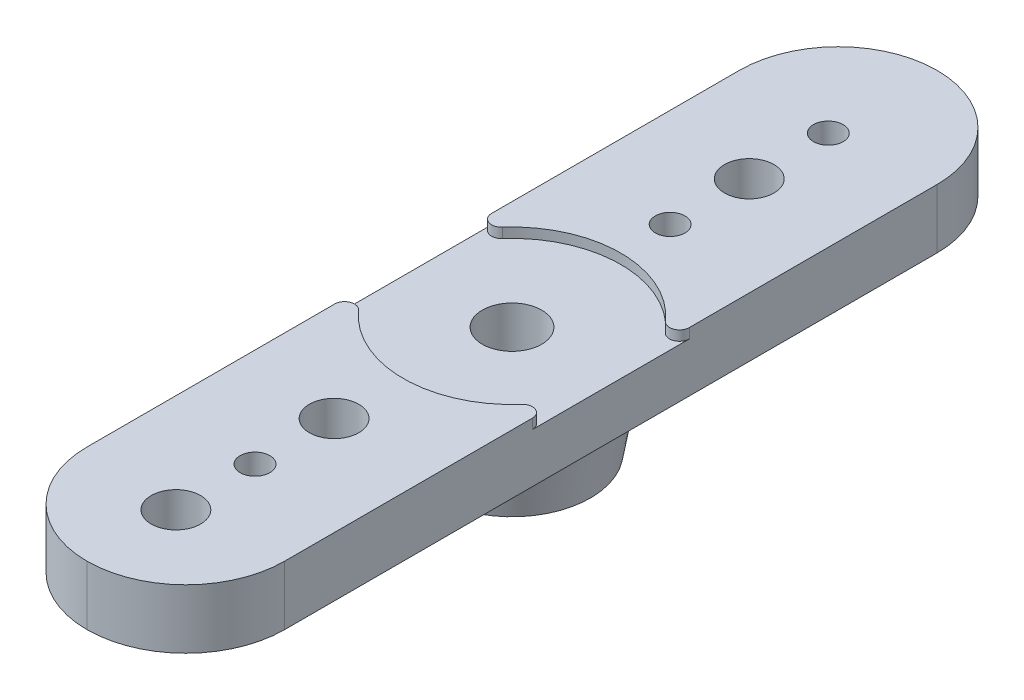
ISO-10303-21;
HEADER;
FILE_DESCRIPTION(('STEP AP214'),'2;1');
FILE_NAME('part.step','',(''),(''),'','','');
FILE_SCHEMA(('AUTOMOTIVE_DESIGN { 1 0 10303 214 1 1 1 1 }'));
ENDSEC;
DATA;
#1=APPLICATION_CONTEXT('core data for automotive mechanical design processes');
#2=APPLICATION_PROTOCOL_DEFINITION('international standard','automotive_design',2000,#1);
#3=PRODUCT_CONTEXT('',#1,'mechanical');
#4=PRODUCT('Part','Part','',(#3));
#5=PRODUCT_RELATED_PRODUCT_CATEGORY('part','',(#4));
#6=PRODUCT_DEFINITION_FORMATION('','',#4);
#7=PRODUCT_DEFINITION_CONTEXT('part definition',#1,'design');
#8=PRODUCT_DEFINITION('design','',#6,#7);
#9=PRODUCT_DEFINITION_SHAPE('','',#8);
#10=(LENGTH_UNIT() NAMED_UNIT(*) SI_UNIT(.MILLI.,.METRE.));
#11=(NAMED_UNIT(*) PLANE_ANGLE_UNIT() SI_UNIT($,.RADIAN.));
#12=(NAMED_UNIT(*) SI_UNIT($,.STERADIAN.) SOLID_ANGLE_UNIT());
#13=UNCERTAINTY_MEASURE_WITH_UNIT(LENGTH_MEASURE(1.E-05),#10,'distance_accuracy_value','');
#14=(GEOMETRIC_REPRESENTATION_CONTEXT(3) GLOBAL_UNCERTAINTY_ASSIGNED_CONTEXT((#13)) GLOBAL_UNIT_ASSIGNED_CONTEXT((#10,
#11,#12)) REPRESENTATION_CONTEXT('',''));
#15=CARTESIAN_POINT('',(0.,0.,0.));
#16=DIRECTION('',(0.,0.,1.));
#17=DIRECTION('',(1.,0.,0.));
#18=AXIS2_PLACEMENT_3D('',#15,#16,#17);
#19=CARTESIAN_POINT('',(0.,3.,0.));
#20=DIRECTION('',(0.,1.,0.));
#21=DIRECTION('',(0.,0.,1.));
#22=AXIS2_PLACEMENT_3D('',#19,#20,#21);
#23=PLANE('',#22);
#24=CARTESIAN_POINT('',(0.,3.,-8.));
#25=DIRECTION('',(0.,1.,0.));
#26=DIRECTION('',(0.,0.,1.));
#27=AXIS2_PLACEMENT_3D('',#24,#25,#26);
#28=CIRCLE('',#27,0.750000000000001);
#29=CARTESIAN_POINT('',(0.,3.,-7.25));
#30=VERTEX_POINT('',#29);
#31=EDGE_CURVE('E250',#30,#30,#28,.T.);
#32=ORIENTED_EDGE('',*,*,#31,.F.);
#33=EDGE_LOOP('',(#32));
#34=FACE_BOUND('',#33,.T.);
#35=CARTESIAN_POINT('',(0.,3.,-16.));
#36=DIRECTION('',(0.,1.,0.));
#37=DIRECTION('',(0.,0.,1.));
#38=AXIS2_PLACEMENT_3D('',#35,#36,#37);
#39=CIRCLE('',#38,0.750000000000001);
#40=CARTESIAN_POINT('',(0.,3.,-15.25));
#41=VERTEX_POINT('',#40);
#42=EDGE_CURVE('E246',#41,#41,#39,.T.);
#43=ORIENTED_EDGE('',*,*,#42,.F.);
#44=EDGE_LOOP('',(#43));
#45=FACE_BOUND('',#44,.T.);
#46=CARTESIAN_POINT('',(0.,3.,-12.));
#47=DIRECTION('',(0.,1.,0.));
#48=DIRECTION('',(0.,0.,1.));
#49=AXIS2_PLACEMENT_3D('',#46,#47,#48);
#50=CIRCLE('',#49,1.25);
#51=CARTESIAN_POINT('',(0.,3.,-10.75));
#52=VERTEX_POINT('',#51);
#53=EDGE_CURVE('E242',#52,#52,#50,.T.);
#54=ORIENTED_EDGE('',*,*,#53,.F.);
#55=EDGE_LOOP('',(#54));
#56=FACE_BOUND('',#55,.T.);
#57=CARTESIAN_POINT('',(0.,3.,0.));
#58=DIRECTION('',(0.,1.,0.));
#59=DIRECTION('',(0.,0.,1.));
#60=AXIS2_PLACEMENT_3D('',#57,#58,#59);
#61=CIRCLE('',#60,5.5);
#62=CARTESIAN_POINT('',(4.125,3.,-3.63790805271381));
#63=VERTEX_POINT('',#62);
#64=CARTESIAN_POINT('',(-4.125,3.,-3.63790805271381));
#65=VERTEX_POINT('',#64);
#66=EDGE_CURVE('E278',#63,#65,#61,.T.);
#67=ORIENTED_EDGE('',*,*,#66,.F.);
#68=CARTESIAN_POINT('',(4.5,3.,-3.96862696659688));
#69=DIRECTION('',(0.,1.,0.));
#70=DIRECTION('',(0.,0.,1.));
#71=AXIS2_PLACEMENT_3D('',#68,#69,#70);
#72=CIRCLE('',#71,0.5);
#73=CARTESIAN_POINT('',(5.,3.,-3.96862696659688));
#74=VERTEX_POINT('',#73);
#75=EDGE_CURVE('E230',#63,#74,#72,.T.);
#76=ORIENTED_EDGE('',*,*,#75,.T.);
#77=DIRECTION('',(0.,0.,-1.));
#78=VECTOR('',#77,1.);
#79=CARTESIAN_POINT('',(5.,3.,-21.5));
#80=LINE('',#79,#78);
#81=CARTESIAN_POINT('',(5.,3.,-16.5));
#82=VERTEX_POINT('',#81);
#83=EDGE_CURVE('E293',#74,#82,#80,.T.);
#84=ORIENTED_EDGE('',*,*,#83,.T.);
#85=CARTESIAN_POINT('',(0.,3.,-16.5));
#86=DIRECTION('',(0.,1.,0.));
#87=DIRECTION('',(0.,0.,1.));
#88=AXIS2_PLACEMENT_3D('',#85,#86,#87);
#89=CIRCLE('',#88,5.);
#90=CARTESIAN_POINT('',(0.,3.,-21.5));
#91=VERTEX_POINT('',#90);
#92=EDGE_CURVE('E186',#82,#91,#89,.T.);
#93=ORIENTED_EDGE('',*,*,#92,.T.);
#94=CARTESIAN_POINT('',(0.,3.,-16.5));
#95=DIRECTION('',(0.,1.,0.));
#96=DIRECTION('',(0.,0.,1.));
#97=AXIS2_PLACEMENT_3D('',#94,#95,#96);
#98=CIRCLE('',#97,5.);
#99=CARTESIAN_POINT('',(-5.,3.,-16.5));
#100=VERTEX_POINT('',#99);
#101=EDGE_CURVE('E188',#91,#100,#98,.T.);
#102=ORIENTED_EDGE('',*,*,#101,.T.);
#103=DIRECTION('',(0.,0.,1.));
#104=VECTOR('',#103,1.);
#105=CARTESIAN_POINT('',(-5.,3.,-21.5));
#106=LINE('',#105,#104);
#107=CARTESIAN_POINT('',(-5.,3.,-3.96862696659689));
#108=VERTEX_POINT('',#107);
#109=EDGE_CURVE('E161',#100,#108,#106,.T.);
#110=ORIENTED_EDGE('',*,*,#109,.T.);
#111=CARTESIAN_POINT('',(-4.5,3.,-3.96862696659689));
#112=DIRECTION('',(0.,1.,0.));
#113=DIRECTION('',(0.,0.,1.));
#114=AXIS2_PLACEMENT_3D('',#111,#112,#113);
#115=CIRCLE('',#114,0.5);
#116=EDGE_CURVE('E52',#108,#65,#115,.T.);
#117=ORIENTED_EDGE('',*,*,#116,.T.);
#118=EDGE_LOOP('',(#67,#76,#84,#93,#102,#110,#117));
#119=FACE_BOUND('',#118,.T.);
#120=ADVANCED_FACE('F35',(#34,#45,#56,#119),#23,.T.);
#121=CARTESIAN_POINT('',(0.,3.,0.));
#122=DIRECTION('',(0.,-1.,0.));
#123=DIRECTION('',(0.,0.,-1.));
#124=AXIS2_PLACEMENT_3D('',#121,#122,#123);
#125=CYLINDRICAL_SURFACE('',#124,1.5);
#126=CARTESIAN_POINT('',(0.,0.,0.));
#127=DIRECTION('',(0.,-1.,0.));
#128=DIRECTION('',(0.,0.,-1.));
#129=AXIS2_PLACEMENT_3D('',#126,#127,#128);
#130=CIRCLE('',#129,1.5);
#131=CARTESIAN_POINT('',(0.,0.,-1.5));
#132=VERTEX_POINT('',#131);
#133=EDGE_CURVE('E283',#132,#132,#130,.T.);
#134=ORIENTED_EDGE('',*,*,#133,.T.);
#135=EDGE_LOOP('',(#134));
#136=FACE_BOUND('',#135,.T.);
#137=CARTESIAN_POINT('',(0.,2.5,0.));
#138=DIRECTION('',(0.,1.,0.));
#139=DIRECTION('',(0.,0.,1.));
#140=AXIS2_PLACEMENT_3D('',#137,#138,#139);
#141=CIRCLE('',#140,1.5);
#142=CARTESIAN_POINT('',(0.,2.5,1.5));
#143=VERTEX_POINT('',#142);
#144=EDGE_CURVE('E203',#143,#143,#141,.F.);
#145=ORIENTED_EDGE('',*,*,#144,.F.);
#146=EDGE_LOOP('',(#145));
#147=FACE_BOUND('',#146,.T.);
#148=ADVANCED_FACE('F354',(#136,#147),#125,.F.);
#149=CARTESIAN_POINT('',(-5.,3.,-21.5));
#150=DIRECTION('',(1.,0.,0.));
#151=DIRECTION('',(0.,0.,-1.));
#152=AXIS2_PLACEMENT_3D('',#149,#150,#151);
#153=PLANE('',#152);
#154=CARTESIAN_POINT('',(-5.,3.,3.96862696659689));
#155=VERTEX_POINT('',#154);
#156=CARTESIAN_POINT('',(-5.,3.,16.5));
#157=VERTEX_POINT('',#156);
#158=EDGE_CURVE('E170',#155,#157,#106,.T.);
#159=ORIENTED_EDGE('',*,*,#158,.F.);
#160=DIRECTION('',(0.,1.,0.));
#161=VECTOR('',#160,1.);
#162=CARTESIAN_POINT('',(-5.,3.,3.96862696659689));
#163=LINE('',#162,#161);
#164=CARTESIAN_POINT('',(-5.,2.5,3.96862696659689));
#165=VERTEX_POINT('',#164);
#166=EDGE_CURVE('E223',#155,#165,#163,.F.);
#167=ORIENTED_EDGE('',*,*,#166,.T.);
#168=DIRECTION('',(0.,0.,1.));
#169=VECTOR('',#168,1.);
#170=CARTESIAN_POINT('',(-5.,2.5,-21.5));
#171=LINE('',#170,#169);
#172=CARTESIAN_POINT('',(-5.,2.5,-3.96862696659689));
#173=VERTEX_POINT('',#172);
#174=EDGE_CURVE('E281',#173,#165,#171,.T.);
#175=ORIENTED_EDGE('',*,*,#174,.F.);
#176=DIRECTION('',(0.,1.,0.));
#177=VECTOR('',#176,1.);
#178=CARTESIAN_POINT('',(-5.,3.,-3.96862696659689));
#179=LINE('',#178,#177);
#180=EDGE_CURVE('E221',#173,#108,#179,.T.);
#181=ORIENTED_EDGE('',*,*,#180,.T.);
#182=ORIENTED_EDGE('',*,*,#109,.F.);
#183=DIRECTION('',(0.,-1.,0.));
#184=VECTOR('',#183,1.);
#185=CARTESIAN_POINT('',(-5.,3.,-16.5));
#186=LINE('',#185,#184);
#187=CARTESIAN_POINT('',(-5.,0.,-16.5));
#188=VERTEX_POINT('',#187);
#189=EDGE_CURVE('E143',#100,#188,#186,.T.);
#190=ORIENTED_EDGE('',*,*,#189,.T.);
#191=DIRECTION('',(0.,0.,1.));
#192=VECTOR('',#191,1.);
#193=CARTESIAN_POINT('',(-5.,0.,-21.5));
#194=LINE('',#193,#192);
#195=CARTESIAN_POINT('',(-5.,0.,16.5));
#196=VERTEX_POINT('',#195);
#197=EDGE_CURVE('E158',#188,#196,#194,.T.);
#198=ORIENTED_EDGE('',*,*,#197,.T.);
#199=DIRECTION('',(0.,-1.,0.));
#200=VECTOR('',#199,1.);
#201=CARTESIAN_POINT('',(-5.,3.,16.5));
#202=LINE('',#201,#200);
#203=EDGE_CURVE('E163',#196,#157,#202,.F.);
#204=ORIENTED_EDGE('',*,*,#203,.T.);
#205=EDGE_LOOP('',(#159,#167,#175,#181,#182,#190,#198,#204));
#206=FACE_BOUND('',#205,.T.);
#207=ADVANCED_FACE('F156',(#206),#153,.F.);
#208=CARTESIAN_POINT('',(5.,3.,-21.5));
#209=DIRECTION('',(-1.,0.,0.));
#210=DIRECTION('',(0.,0.,1.));
#211=AXIS2_PLACEMENT_3D('',#208,#209,#210);
#212=PLANE('',#211);
#213=DIRECTION('',(0.,0.,-1.));
#214=VECTOR('',#213,1.);
#215=CARTESIAN_POINT('',(5.,2.5,-21.5));
#216=LINE('',#215,#214);
#217=CARTESIAN_POINT('',(5.,2.5,3.96862696659688));
#218=VERTEX_POINT('',#217);
#219=CARTESIAN_POINT('',(5.,2.5,-3.96862696659688));
#220=VERTEX_POINT('',#219);
#221=EDGE_CURVE('E206',#218,#220,#216,.T.);
#222=ORIENTED_EDGE('',*,*,#221,.F.);
#223=DIRECTION('',(0.,1.,0.));
#224=VECTOR('',#223,1.);
#225=CARTESIAN_POINT('',(5.,3.,3.96862696659688));
#226=LINE('',#225,#224);
#227=CARTESIAN_POINT('',(5.,3.,3.96862696659688));
#228=VERTEX_POINT('',#227);
#229=EDGE_CURVE('E210',#218,#228,#226,.T.);
#230=ORIENTED_EDGE('',*,*,#229,.T.);
#231=CARTESIAN_POINT('',(5.,3.,16.5));
#232=VERTEX_POINT('',#231);
#233=EDGE_CURVE('E175',#232,#228,#80,.T.);
#234=ORIENTED_EDGE('',*,*,#233,.F.);
#235=DIRECTION('',(0.,-1.,0.));
#236=VECTOR('',#235,1.);
#237=CARTESIAN_POINT('',(5.,3.,16.5));
#238=LINE('',#237,#236);
#239=CARTESIAN_POINT('',(5.,0.,16.5));
#240=VERTEX_POINT('',#239);
#241=EDGE_CURVE('E190',#232,#240,#238,.T.);
#242=ORIENTED_EDGE('',*,*,#241,.T.);
#243=DIRECTION('',(0.,0.,-1.));
#244=VECTOR('',#243,1.);
#245=CARTESIAN_POINT('',(5.,0.,-21.5));
#246=LINE('',#245,#244);
#247=CARTESIAN_POINT('',(5.,0.,-16.5));
#248=VERTEX_POINT('',#247);
#249=EDGE_CURVE('E167',#240,#248,#246,.T.);
#250=ORIENTED_EDGE('',*,*,#249,.T.);
#251=DIRECTION('',(0.,-1.,0.));
#252=VECTOR('',#251,1.);
#253=CARTESIAN_POINT('',(5.,3.,-16.5));
#254=LINE('',#253,#252);
#255=EDGE_CURVE('E193',#248,#82,#254,.F.);
#256=ORIENTED_EDGE('',*,*,#255,.T.);
#257=ORIENTED_EDGE('',*,*,#83,.F.);
#258=DIRECTION('',(0.,1.,0.));
#259=VECTOR('',#258,1.);
#260=CARTESIAN_POINT('',(5.,3.,-3.96862696659688));
#261=LINE('',#260,#259);
#262=EDGE_CURVE('E195',#74,#220,#261,.F.);
#263=ORIENTED_EDGE('',*,*,#262,.T.);
#264=EDGE_LOOP('',(#222,#230,#234,#242,#250,#256,#257,#263));
#265=FACE_BOUND('',#264,.T.);
#266=ADVANCED_FACE('F310',(#265),#212,.F.);
#267=CARTESIAN_POINT('',(0.,3.,13.));
#268=DIRECTION('',(0.,1.,0.));
#269=DIRECTION('',(0.,0.,1.));
#270=AXIS2_PLACEMENT_3D('',#267,#268,#269);
#271=CIRCLE('',#270,0.750000000000001);
#272=CARTESIAN_POINT('',(0.,3.,13.75));
#273=VERTEX_POINT('',#272);
#274=EDGE_CURVE('E266',#273,#273,#271,.T.);
#275=ORIENTED_EDGE('',*,*,#274,.F.);
#276=EDGE_LOOP('',(#275));
#277=FACE_BOUND('',#276,.T.);
#278=CARTESIAN_POINT('',(0.,3.,9.));
#279=DIRECTION('',(0.,1.,0.));
#280=DIRECTION('',(0.,0.,1.));
#281=AXIS2_PLACEMENT_3D('',#278,#279,#280);
#282=CIRCLE('',#281,1.25);
#283=CARTESIAN_POINT('',(0.,3.,10.25));
#284=VERTEX_POINT('',#283);
#285=EDGE_CURVE('E256',#284,#284,#282,.T.);
#286=ORIENTED_EDGE('',*,*,#285,.F.);
#287=EDGE_LOOP('',(#286));
#288=FACE_BOUND('',#287,.T.);
#289=CARTESIAN_POINT('',(0.,3.,17.));
#290=DIRECTION('',(0.,1.,0.));
#291=DIRECTION('',(0.,0.,1.));
#292=AXIS2_PLACEMENT_3D('',#289,#290,#291);
#293=CIRCLE('',#292,1.25);
#294=CARTESIAN_POINT('',(0.,3.,18.25));
#295=VERTEX_POINT('',#294);
#296=EDGE_CURVE('E253',#295,#295,#293,.T.);
#297=ORIENTED_EDGE('',*,*,#296,.F.);
#298=EDGE_LOOP('',(#297));
#299=FACE_BOUND('',#298,.T.);
#300=ORIENTED_EDGE('',*,*,#233,.T.);
#301=CARTESIAN_POINT('',(4.5,3.,3.96862696659688));
#302=DIRECTION('',(0.,1.,0.));
#303=DIRECTION('',(0.,0.,1.));
#304=AXIS2_PLACEMENT_3D('',#301,#302,#303);
#305=CIRCLE('',#304,0.5);
#306=CARTESIAN_POINT('',(4.125,3.,3.63790805271381));
#307=VERTEX_POINT('',#306);
#308=EDGE_CURVE('E215',#228,#307,#305,.T.);
#309=ORIENTED_EDGE('',*,*,#308,.T.);
#310=CARTESIAN_POINT('',(-4.125,3.,3.63790805271381));
#311=VERTEX_POINT('',#310);
#312=EDGE_CURVE('E241',#311,#307,#61,.T.);
#313=ORIENTED_EDGE('',*,*,#312,.F.);
#314=CARTESIAN_POINT('',(-4.5,3.,3.96862696659689));
#315=DIRECTION('',(0.,1.,0.));
#316=DIRECTION('',(0.,0.,1.));
#317=AXIS2_PLACEMENT_3D('',#314,#315,#316);
#318=CIRCLE('',#317,0.5);
#319=EDGE_CURVE('E213',#311,#155,#318,.T.);
#320=ORIENTED_EDGE('',*,*,#319,.T.);
#321=ORIENTED_EDGE('',*,*,#158,.T.);
#322=CARTESIAN_POINT('',(0.,3.,16.5));
#323=DIRECTION('',(0.,1.,0.));
#324=DIRECTION('',(0.,0.,1.));
#325=AXIS2_PLACEMENT_3D('',#322,#323,#324);
#326=CIRCLE('',#325,5.);
#327=CARTESIAN_POINT('',(0.,3.,21.5));
#328=VERTEX_POINT('',#327);
#329=EDGE_CURVE('E149',#157,#328,#326,.T.);
#330=ORIENTED_EDGE('',*,*,#329,.T.);
#331=CARTESIAN_POINT('',(0.,3.,16.5));
#332=DIRECTION('',(0.,1.,0.));
#333=DIRECTION('',(0.,0.,1.));
#334=AXIS2_PLACEMENT_3D('',#331,#332,#333);
#335=CIRCLE('',#334,5.);
#336=EDGE_CURVE('E184',#328,#232,#335,.T.);
#337=ORIENTED_EDGE('',*,*,#336,.T.);
#338=EDGE_LOOP('',(#300,#309,#313,#320,#321,#330,#337));
#339=FACE_BOUND('',#338,.T.);
#340=ADVANCED_FACE('F296',(#277,#288,#299,#339),#23,.T.);
#341=CARTESIAN_POINT('',(0.,0.,0.));
#342=DIRECTION('',(0.,1.,0.));
#343=DIRECTION('',(0.,0.,1.));
#344=AXIS2_PLACEMENT_3D('',#341,#342,#343);
#345=PLANE('',#344);
#346=CARTESIAN_POINT('',(0.,0.,13.));
#347=DIRECTION('',(0.,1.,0.));
#348=DIRECTION('',(0.,0.,1.));
#349=AXIS2_PLACEMENT_3D('',#346,#347,#348);
#350=CIRCLE('',#349,0.750000000000001);
#351=CARTESIAN_POINT('',(0.,0.,13.75));
#352=VERTEX_POINT('',#351);
#353=EDGE_CURVE('E39',#352,#352,#350,.T.);
#354=ORIENTED_EDGE('',*,*,#353,.T.);
#355=EDGE_LOOP('',(#354));
#356=FACE_BOUND('',#355,.T.);
#357=CARTESIAN_POINT('',(0.,0.,9.));
#358=DIRECTION('',(0.,1.,0.));
#359=DIRECTION('',(0.,0.,1.));
#360=AXIS2_PLACEMENT_3D('',#357,#358,#359);
#361=CIRCLE('',#360,1.25);
#362=CARTESIAN_POINT('',(0.,0.,10.25));
#363=VERTEX_POINT('',#362);
#364=EDGE_CURVE('E254',#363,#363,#361,.T.);
#365=ORIENTED_EDGE('',*,*,#364,.T.);
#366=EDGE_LOOP('',(#365));
#367=FACE_BOUND('',#366,.T.);
#368=CARTESIAN_POINT('',(0.,0.,17.));
#369=DIRECTION('',(0.,1.,0.));
#370=DIRECTION('',(0.,0.,1.));
#371=AXIS2_PLACEMENT_3D('',#368,#369,#370);
#372=CIRCLE('',#371,1.25);
#373=CARTESIAN_POINT('',(0.,0.,18.25));
#374=VERTEX_POINT('',#373);
#375=EDGE_CURVE('E251',#374,#374,#372,.T.);
#376=ORIENTED_EDGE('',*,*,#375,.T.);
#377=EDGE_LOOP('',(#376));
#378=FACE_BOUND('',#377,.T.);
#379=CARTESIAN_POINT('',(0.,0.,-8.));
#380=DIRECTION('',(0.,1.,0.));
#381=DIRECTION('',(0.,0.,1.));
#382=AXIS2_PLACEMENT_3D('',#379,#380,#381);
#383=CIRCLE('',#382,0.750000000000001);
#384=CARTESIAN_POINT('',(0.,0.,-7.25));
#385=VERTEX_POINT('',#384);
#386=EDGE_CURVE('E247',#385,#385,#383,.T.);
#387=ORIENTED_EDGE('',*,*,#386,.T.);
#388=EDGE_LOOP('',(#387));
#389=FACE_BOUND('',#388,.T.);
#390=CARTESIAN_POINT('',(0.,0.,-16.));
#391=DIRECTION('',(0.,1.,0.));
#392=DIRECTION('',(0.,0.,1.));
#393=AXIS2_PLACEMENT_3D('',#390,#391,#392);
#394=CIRCLE('',#393,0.750000000000001);
#395=CARTESIAN_POINT('',(0.,0.,-15.25));
#396=VERTEX_POINT('',#395);
#397=EDGE_CURVE('E243',#396,#396,#394,.T.);
#398=ORIENTED_EDGE('',*,*,#397,.T.);
#399=EDGE_LOOP('',(#398));
#400=FACE_BOUND('',#399,.T.);
#401=CARTESIAN_POINT('',(0.,0.,-12.));
#402=DIRECTION('',(0.,1.,0.));
#403=DIRECTION('',(0.,0.,1.));
#404=AXIS2_PLACEMENT_3D('',#401,#402,#403);
#405=CIRCLE('',#404,1.25);
#406=CARTESIAN_POINT('',(0.,0.,-10.75));
#407=VERTEX_POINT('',#406);
#408=EDGE_CURVE('E238',#407,#407,#405,.T.);
#409=ORIENTED_EDGE('',*,*,#408,.T.);
#410=EDGE_LOOP('',(#409));
#411=FACE_BOUND('',#410,.T.);
#412=CARTESIAN_POINT('',(0.,0.,0.));
#413=DIRECTION('',(0.,1.,0.));
#414=DIRECTION('',(0.,0.,1.));
#415=AXIS2_PLACEMENT_3D('',#412,#413,#414);
#416=CIRCLE('',#415,4.5);
#417=CARTESIAN_POINT('',(0.,0.,4.5));
#418=VERTEX_POINT('',#417);
#419=EDGE_CURVE('E202',#418,#418,#416,.T.);
#420=ORIENTED_EDGE('',*,*,#419,.T.);
#421=EDGE_LOOP('',(#420));
#422=FACE_BOUND('',#421,.T.);
#423=ORIENTED_EDGE('',*,*,#197,.F.);
#424=CARTESIAN_POINT('',(0.,0.,-16.5));
#425=DIRECTION('',(0.,1.,0.));
#426=DIRECTION('',(0.,0.,1.));
#427=AXIS2_PLACEMENT_3D('',#424,#425,#426);
#428=CIRCLE('',#427,5.);
#429=CARTESIAN_POINT('',(0.,0.,-21.5));
#430=VERTEX_POINT('',#429);
#431=EDGE_CURVE('E139',#188,#430,#428,.F.);
#432=ORIENTED_EDGE('',*,*,#431,.T.);
#433=CARTESIAN_POINT('',(0.,0.,-16.5));
#434=DIRECTION('',(0.,1.,0.));
#435=DIRECTION('',(0.,0.,1.));
#436=AXIS2_PLACEMENT_3D('',#433,#434,#435);
#437=CIRCLE('',#436,5.);
#438=EDGE_CURVE('E150',#430,#248,#437,.F.);
#439=ORIENTED_EDGE('',*,*,#438,.T.);
#440=ORIENTED_EDGE('',*,*,#249,.F.);
#441=CARTESIAN_POINT('',(0.,0.,16.5));
#442=DIRECTION('',(0.,1.,0.));
#443=DIRECTION('',(0.,0.,1.));
#444=AXIS2_PLACEMENT_3D('',#441,#442,#443);
#445=CIRCLE('',#444,5.);
#446=CARTESIAN_POINT('',(0.,0.,21.5));
#447=VERTEX_POINT('',#446);
#448=EDGE_CURVE('E180',#240,#447,#445,.F.);
#449=ORIENTED_EDGE('',*,*,#448,.T.);
#450=CARTESIAN_POINT('',(0.,0.,16.5));
#451=DIRECTION('',(0.,1.,0.));
#452=DIRECTION('',(0.,0.,1.));
#453=AXIS2_PLACEMENT_3D('',#450,#451,#452);
#454=CIRCLE('',#453,5.);
#455=EDGE_CURVE('E162',#447,#196,#454,.F.);
#456=ORIENTED_EDGE('',*,*,#455,.T.);
#457=EDGE_LOOP('',(#423,#432,#439,#440,#449,#456));
#458=FACE_BOUND('',#457,.T.);
#459=ADVANCED_FACE('F165',(#356,#367,#378,#389,#400,#411,#422,#458),#345,.F.);
#460=CARTESIAN_POINT('',(0.,3.,-16.5));
#461=DIRECTION('',(0.,-1.,0.));
#462=DIRECTION('',(0.,0.,-1.));
#463=AXIS2_PLACEMENT_3D('',#460,#461,#462);
#464=CYLINDRICAL_SURFACE('',#463,5.);
#465=DIRECTION('',(0.,-1.,0.));
#466=VECTOR('',#465,1.);
#467=CARTESIAN_POINT('',(0.,3.,-21.5));
#468=LINE('',#467,#466);
#469=EDGE_CURVE('E145',#91,#430,#468,.T.);
#470=ORIENTED_EDGE('',*,*,#469,.F.);
#471=ORIENTED_EDGE('',*,*,#92,.F.);
#472=ORIENTED_EDGE('',*,*,#255,.F.);
#473=ORIENTED_EDGE('',*,*,#438,.F.);
#474=EDGE_LOOP('',(#470,#471,#472,#473));
#475=FACE_BOUND('',#474,.T.);
#476=ADVANCED_FACE('F342',(#475),#464,.T.);
#477=CARTESIAN_POINT('',(0.,3.,-16.5));
#478=DIRECTION('',(0.,-1.,0.));
#479=DIRECTION('',(0.,0.,-1.));
#480=AXIS2_PLACEMENT_3D('',#477,#478,#479);
#481=CYLINDRICAL_SURFACE('',#480,5.);
#482=ORIENTED_EDGE('',*,*,#101,.F.);
#483=ORIENTED_EDGE('',*,*,#469,.T.);
#484=ORIENTED_EDGE('',*,*,#431,.F.);
#485=ORIENTED_EDGE('',*,*,#189,.F.);
#486=EDGE_LOOP('',(#482,#483,#484,#485));
#487=FACE_BOUND('',#486,.T.);
#488=ADVANCED_FACE('F142',(#487),#481,.T.);
#489=CARTESIAN_POINT('',(0.,3.,16.5));
#490=DIRECTION('',(0.,-1.,0.));
#491=DIRECTION('',(0.,0.,-1.));
#492=AXIS2_PLACEMENT_3D('',#489,#490,#491);
#493=CYLINDRICAL_SURFACE('',#492,5.);
#494=DIRECTION('',(0.,-1.,0.));
#495=VECTOR('',#494,1.);
#496=CARTESIAN_POINT('',(0.,3.,21.5));
#497=LINE('',#496,#495);
#498=EDGE_CURVE('E172',#328,#447,#497,.T.);
#499=ORIENTED_EDGE('',*,*,#498,.F.);
#500=ORIENTED_EDGE('',*,*,#329,.F.);
#501=ORIENTED_EDGE('',*,*,#203,.F.);
#502=ORIENTED_EDGE('',*,*,#455,.F.);
#503=EDGE_LOOP('',(#499,#500,#501,#502));
#504=FACE_BOUND('',#503,.T.);
#505=ADVANCED_FACE('F303',(#504),#493,.T.);
#506=CARTESIAN_POINT('',(0.,3.,16.5));
#507=DIRECTION('',(0.,-1.,0.));
#508=DIRECTION('',(0.,0.,-1.));
#509=AXIS2_PLACEMENT_3D('',#506,#507,#508);
#510=CYLINDRICAL_SURFACE('',#509,5.);
#511=ORIENTED_EDGE('',*,*,#336,.F.);
#512=ORIENTED_EDGE('',*,*,#498,.T.);
#513=ORIENTED_EDGE('',*,*,#448,.F.);
#514=ORIENTED_EDGE('',*,*,#241,.F.);
#515=EDGE_LOOP('',(#511,#512,#513,#514));
#516=FACE_BOUND('',#515,.T.);
#517=ADVANCED_FACE('F307',(#516),#510,.T.);
#518=CARTESIAN_POINT('',(0.,0.,0.));
#519=DIRECTION('',(0.,1.,0.));
#520=DIRECTION('',(0.,0.,1.));
#521=AXIS2_PLACEMENT_3D('',#518,#519,#520);
#522=CONICAL_SURFACE('',#521,4.5,0.174532925199433);
#523=CARTESIAN_POINT('',(0.,-3.,0.));
#524=DIRECTION('',(0.,1.,0.));
#525=DIRECTION('',(0.,0.,1.));
#526=AXIS2_PLACEMENT_3D('',#523,#524,#525);
#527=CIRCLE('',#526,3.9710190578746);
#528=CARTESIAN_POINT('',(0.,-3.,3.9710190578746));
#529=VERTEX_POINT('',#528);
#530=EDGE_CURVE('E199',#529,#529,#527,.T.);
#531=ORIENTED_EDGE('',*,*,#530,.T.);
#532=EDGE_LOOP('',(#531));
#533=FACE_BOUND('',#532,.T.);
#534=ORIENTED_EDGE('',*,*,#419,.F.);
#535=EDGE_LOOP('',(#534));
#536=FACE_BOUND('',#535,.T.);
#537=ADVANCED_FACE('F394',(#533,#536),#522,.T.);
#538=CARTESIAN_POINT('',(0.,-3.,0.));
#539=DIRECTION('',(0.,1.,0.));
#540=DIRECTION('',(0.,0.,1.));
#541=AXIS2_PLACEMENT_3D('',#538,#539,#540);
#542=PLANE('',#541);
#543=CARTESIAN_POINT('',(0.,-3.,0.));
#544=DIRECTION('',(0.,-1.,0.));
#545=DIRECTION('',(0.,0.,-1.));
#546=AXIS2_PLACEMENT_3D('',#543,#544,#545);
#547=CIRCLE('',#546,3.);
#548=CARTESIAN_POINT('',(0.,-3.,-3.));
#549=VERTEX_POINT('',#548);
#550=EDGE_CURVE('E286',#549,#549,#547,.T.);
#551=ORIENTED_EDGE('',*,*,#550,.F.);
#552=EDGE_LOOP('',(#551));
#553=FACE_BOUND('',#552,.T.);
#554=ORIENTED_EDGE('',*,*,#530,.F.);
#555=EDGE_LOOP('',(#554));
#556=FACE_BOUND('',#555,.T.);
#557=ADVANCED_FACE('F396',(#553,#556),#542,.F.);
#558=CARTESIAN_POINT('',(0.,0.,0.));
#559=DIRECTION('',(0.,-1.,0.));
#560=DIRECTION('',(0.,0.,-1.));
#561=AXIS2_PLACEMENT_3D('',#558,#559,#560);
#562=CYLINDRICAL_SURFACE('',#561,3.);
#563=CARTESIAN_POINT('',(0.,0.,0.));
#564=DIRECTION('',(0.,-1.,0.));
#565=DIRECTION('',(0.,0.,-1.));
#566=AXIS2_PLACEMENT_3D('',#563,#564,#565);
#567=CIRCLE('',#566,3.);
#568=CARTESIAN_POINT('',(0.,0.,-3.));
#569=VERTEX_POINT('',#568);
#570=EDGE_CURVE('E287',#569,#569,#567,.T.);
#571=ORIENTED_EDGE('',*,*,#570,.F.);
#572=EDGE_LOOP('',(#571));
#573=FACE_BOUND('',#572,.T.);
#574=ORIENTED_EDGE('',*,*,#550,.T.);
#575=EDGE_LOOP('',(#574));
#576=FACE_BOUND('',#575,.T.);
#577=ADVANCED_FACE('F403',(#573,#576),#562,.F.);
#578=CARTESIAN_POINT('',(0.,0.,0.));
#579=DIRECTION('',(0.,-1.,0.));
#580=DIRECTION('',(0.,0.,-1.));
#581=AXIS2_PLACEMENT_3D('',#578,#579,#580);
#582=PLANE('',#581);
#583=ORIENTED_EDGE('',*,*,#133,.F.);
#584=EDGE_LOOP('',(#583));
#585=FACE_BOUND('',#584,.T.);
#586=ORIENTED_EDGE('',*,*,#570,.T.);
#587=EDGE_LOOP('',(#586));
#588=FACE_BOUND('',#587,.T.);
#589=ADVANCED_FACE('F433',(#585,#588),#582,.T.);
#590=CARTESIAN_POINT('',(0.,2.5,0.));
#591=DIRECTION('',(0.,1.,0.));
#592=DIRECTION('',(0.,0.,1.));
#593=AXIS2_PLACEMENT_3D('',#590,#591,#592);
#594=CYLINDRICAL_SURFACE('',#593,5.5);
#595=CARTESIAN_POINT('',(0.,2.5,0.));
#596=DIRECTION('',(0.,1.,0.));
#597=DIRECTION('',(0.,0.,1.));
#598=AXIS2_PLACEMENT_3D('',#595,#596,#597);
#599=CIRCLE('',#598,5.5);
#600=CARTESIAN_POINT('',(4.125,2.5,-3.63790805271381));
#601=VERTEX_POINT('',#600);
#602=CARTESIAN_POINT('',(-4.125,2.5,-3.63790805271381));
#603=VERTEX_POINT('',#602);
#604=EDGE_CURVE('E207',#601,#603,#599,.T.);
#605=ORIENTED_EDGE('',*,*,#604,.F.);
#606=DIRECTION('',(0.,1.,0.));
#607=VECTOR('',#606,1.);
#608=CARTESIAN_POINT('',(4.125,2.5,-3.63790805271381));
#609=LINE('',#608,#607);
#610=EDGE_CURVE('E59',#601,#63,#609,.T.);
#611=ORIENTED_EDGE('',*,*,#610,.T.);
#612=ORIENTED_EDGE('',*,*,#66,.T.);
#613=DIRECTION('',(0.,1.,0.));
#614=VECTOR('',#613,1.);
#615=CARTESIAN_POINT('',(-4.125,2.5,-3.63790805271381));
#616=LINE('',#615,#614);
#617=EDGE_CURVE('E226',#65,#603,#616,.F.);
#618=ORIENTED_EDGE('',*,*,#617,.T.);
#619=EDGE_LOOP('',(#605,#611,#612,#618));
#620=FACE_BOUND('',#619,.T.);
#621=ADVANCED_FACE('F332',(#620),#594,.F.);
#622=ORIENTED_EDGE('',*,*,#312,.T.);
#623=DIRECTION('',(0.,1.,0.));
#624=VECTOR('',#623,1.);
#625=CARTESIAN_POINT('',(4.125,2.5,3.63790805271381));
#626=LINE('',#625,#624);
#627=CARTESIAN_POINT('',(4.125,2.5,3.63790805271381));
#628=VERTEX_POINT('',#627);
#629=EDGE_CURVE('E219',#307,#628,#626,.F.);
#630=ORIENTED_EDGE('',*,*,#629,.T.);
#631=CARTESIAN_POINT('',(-4.125,2.5,3.63790805271381));
#632=VERTEX_POINT('',#631);
#633=EDGE_CURVE('E277',#632,#628,#599,.T.);
#634=ORIENTED_EDGE('',*,*,#633,.F.);
#635=DIRECTION('',(0.,1.,0.));
#636=VECTOR('',#635,1.);
#637=CARTESIAN_POINT('',(-4.125,2.5,3.63790805271381));
#638=LINE('',#637,#636);
#639=EDGE_CURVE('E217',#632,#311,#638,.T.);
#640=ORIENTED_EDGE('',*,*,#639,.T.);
#641=EDGE_LOOP('',(#622,#630,#634,#640));
#642=FACE_BOUND('',#641,.T.);
#643=ADVANCED_FACE('F319',(#642),#594,.F.);
#644=CARTESIAN_POINT('',(0.,2.5,0.));
#645=DIRECTION('',(0.,1.,0.));
#646=DIRECTION('',(0.,0.,1.));
#647=AXIS2_PLACEMENT_3D('',#644,#645,#646);
#648=PLANE('',#647);
#649=ORIENTED_EDGE('',*,*,#144,.T.);
#650=EDGE_LOOP('',(#649));
#651=FACE_BOUND('',#650,.T.);
#652=ORIENTED_EDGE('',*,*,#174,.T.);
#653=CARTESIAN_POINT('',(-4.5,2.5,3.96862696659689));
#654=DIRECTION('',(0.,1.,0.));
#655=DIRECTION('',(0.,0.,1.));
#656=AXIS2_PLACEMENT_3D('',#653,#654,#655);
#657=CIRCLE('',#656,0.5);
#658=EDGE_CURVE('E235',#165,#632,#657,.F.);
#659=ORIENTED_EDGE('',*,*,#658,.T.);
#660=ORIENTED_EDGE('',*,*,#633,.T.);
#661=CARTESIAN_POINT('',(4.5,2.5,3.96862696659688));
#662=DIRECTION('',(0.,1.,0.));
#663=DIRECTION('',(0.,0.,1.));
#664=AXIS2_PLACEMENT_3D('',#661,#662,#663);
#665=CIRCLE('',#664,0.5);
#666=EDGE_CURVE('E232',#628,#218,#665,.F.);
#667=ORIENTED_EDGE('',*,*,#666,.T.);
#668=ORIENTED_EDGE('',*,*,#221,.T.);
#669=CARTESIAN_POINT('',(4.5,2.5,-3.96862696659688));
#670=DIRECTION('',(0.,1.,0.));
#671=DIRECTION('',(0.,0.,1.));
#672=AXIS2_PLACEMENT_3D('',#669,#670,#671);
#673=CIRCLE('',#672,0.5);
#674=EDGE_CURVE('E44',#220,#601,#673,.F.);
#675=ORIENTED_EDGE('',*,*,#674,.T.);
#676=ORIENTED_EDGE('',*,*,#604,.T.);
#677=CARTESIAN_POINT('',(-4.5,2.5,-3.96862696659689));
#678=DIRECTION('',(0.,1.,0.));
#679=DIRECTION('',(0.,0.,1.));
#680=AXIS2_PLACEMENT_3D('',#677,#678,#679);
#681=CIRCLE('',#680,0.5);
#682=EDGE_CURVE('E11',#603,#173,#681,.F.);
#683=ORIENTED_EDGE('',*,*,#682,.T.);
#684=EDGE_LOOP('',(#652,#659,#660,#667,#668,#675,#676,#683));
#685=FACE_BOUND('',#684,.T.);
#686=ADVANCED_FACE('F329',(#651,#685),#648,.T.);
#687=CARTESIAN_POINT('',(4.5,2.5,3.96862696659688));
#688=DIRECTION('',(0.,1.,0.));
#689=DIRECTION('',(0.,0.,1.));
#690=AXIS2_PLACEMENT_3D('',#687,#688,#689);
#691=CYLINDRICAL_SURFACE('',#690,0.5);
#692=ORIENTED_EDGE('',*,*,#666,.F.);
#693=ORIENTED_EDGE('',*,*,#629,.F.);
#694=ORIENTED_EDGE('',*,*,#308,.F.);
#695=ORIENTED_EDGE('',*,*,#229,.F.);
#696=EDGE_LOOP('',(#692,#693,#694,#695));
#697=FACE_BOUND('',#696,.T.);
#698=ADVANCED_FACE('F315',(#697),#691,.T.);
#699=CARTESIAN_POINT('',(-4.5,2.5,3.96862696659689));
#700=DIRECTION('',(0.,1.,0.));
#701=DIRECTION('',(0.,0.,1.));
#702=AXIS2_PLACEMENT_3D('',#699,#700,#701);
#703=CYLINDRICAL_SURFACE('',#702,0.5);
#704=ORIENTED_EDGE('',*,*,#319,.F.);
#705=ORIENTED_EDGE('',*,*,#639,.F.);
#706=ORIENTED_EDGE('',*,*,#658,.F.);
#707=ORIENTED_EDGE('',*,*,#166,.F.);
#708=EDGE_LOOP('',(#704,#705,#706,#707));
#709=FACE_BOUND('',#708,.T.);
#710=ADVANCED_FACE('F325',(#709),#703,.T.);
#711=CARTESIAN_POINT('',(4.5,2.5,-3.96862696659688));
#712=DIRECTION('',(0.,1.,0.));
#713=DIRECTION('',(0.,0.,1.));
#714=AXIS2_PLACEMENT_3D('',#711,#712,#713);
#715=CYLINDRICAL_SURFACE('',#714,0.5);
#716=ORIENTED_EDGE('',*,*,#75,.F.);
#717=ORIENTED_EDGE('',*,*,#610,.F.);
#718=ORIENTED_EDGE('',*,*,#674,.F.);
#719=ORIENTED_EDGE('',*,*,#262,.F.);
#720=EDGE_LOOP('',(#716,#717,#718,#719));
#721=FACE_BOUND('',#720,.T.);
#722=ADVANCED_FACE('F337',(#721),#715,.T.);
#723=CARTESIAN_POINT('',(-4.5,2.5,-3.96862696659689));
#724=DIRECTION('',(0.,1.,0.));
#725=DIRECTION('',(0.,0.,1.));
#726=AXIS2_PLACEMENT_3D('',#723,#724,#725);
#727=CYLINDRICAL_SURFACE('',#726,0.5);
#728=ORIENTED_EDGE('',*,*,#682,.F.);
#729=ORIENTED_EDGE('',*,*,#617,.F.);
#730=ORIENTED_EDGE('',*,*,#116,.F.);
#731=ORIENTED_EDGE('',*,*,#180,.F.);
#732=EDGE_LOOP('',(#728,#729,#730,#731));
#733=FACE_BOUND('',#732,.T.);
#734=ADVANCED_FACE('F37',(#733),#727,.T.);
#735=CARTESIAN_POINT('',(0.,-3.,-12.));
#736=DIRECTION('',(0.,1.,0.));
#737=DIRECTION('',(0.,0.,1.));
#738=AXIS2_PLACEMENT_3D('',#735,#736,#737);
#739=CYLINDRICAL_SURFACE('',#738,1.25);
#740=ORIENTED_EDGE('',*,*,#53,.T.);
#741=EDGE_LOOP('',(#740));
#742=FACE_BOUND('',#741,.T.);
#743=ORIENTED_EDGE('',*,*,#408,.F.);
#744=EDGE_LOOP('',(#743));
#745=FACE_BOUND('',#744,.T.);
#746=ADVANCED_FACE('F414',(#742,#745),#739,.F.);
#747=CARTESIAN_POINT('',(0.,-3.,-16.));
#748=DIRECTION('',(0.,1.,0.));
#749=DIRECTION('',(0.,0.,1.));
#750=AXIS2_PLACEMENT_3D('',#747,#748,#749);
#751=CYLINDRICAL_SURFACE('',#750,0.750000000000001);
#752=ORIENTED_EDGE('',*,*,#42,.T.);
#753=EDGE_LOOP('',(#752));
#754=FACE_BOUND('',#753,.T.);
#755=ORIENTED_EDGE('',*,*,#397,.F.);
#756=EDGE_LOOP('',(#755));
#757=FACE_BOUND('',#756,.T.);
#758=ADVANCED_FACE('F418',(#754,#757),#751,.F.);
#759=CARTESIAN_POINT('',(0.,-3.,-8.));
#760=DIRECTION('',(0.,1.,0.));
#761=DIRECTION('',(0.,0.,1.));
#762=AXIS2_PLACEMENT_3D('',#759,#760,#761);
#763=CYLINDRICAL_SURFACE('',#762,0.750000000000001);
#764=ORIENTED_EDGE('',*,*,#31,.T.);
#765=EDGE_LOOP('',(#764));
#766=FACE_BOUND('',#765,.T.);
#767=ORIENTED_EDGE('',*,*,#386,.F.);
#768=EDGE_LOOP('',(#767));
#769=FACE_BOUND('',#768,.T.);
#770=ADVANCED_FACE('F381',(#766,#769),#763,.F.);
#771=CARTESIAN_POINT('',(0.,-3.,17.));
#772=DIRECTION('',(0.,1.,0.));
#773=DIRECTION('',(0.,0.,1.));
#774=AXIS2_PLACEMENT_3D('',#771,#772,#773);
#775=CYLINDRICAL_SURFACE('',#774,1.25);
#776=ORIENTED_EDGE('',*,*,#296,.T.);
#777=EDGE_LOOP('',(#776));
#778=FACE_BOUND('',#777,.T.);
#779=ORIENTED_EDGE('',*,*,#375,.F.);
#780=EDGE_LOOP('',(#779));
#781=FACE_BOUND('',#780,.T.);
#782=ADVANCED_FACE('F377',(#778,#781),#775,.F.);
#783=CARTESIAN_POINT('',(0.,-3.,9.));
#784=DIRECTION('',(0.,1.,0.));
#785=DIRECTION('',(0.,0.,1.));
#786=AXIS2_PLACEMENT_3D('',#783,#784,#785);
#787=CYLINDRICAL_SURFACE('',#786,1.25);
#788=ORIENTED_EDGE('',*,*,#285,.T.);
#789=EDGE_LOOP('',(#788));
#790=FACE_BOUND('',#789,.T.);
#791=ORIENTED_EDGE('',*,*,#364,.F.);
#792=EDGE_LOOP('',(#791));
#793=FACE_BOUND('',#792,.T.);
#794=ADVANCED_FACE('F380',(#790,#793),#787,.F.);
#795=CARTESIAN_POINT('',(0.,-3.,13.));
#796=DIRECTION('',(0.,1.,0.));
#797=DIRECTION('',(0.,0.,1.));
#798=AXIS2_PLACEMENT_3D('',#795,#796,#797);
#799=CYLINDRICAL_SURFACE('',#798,0.750000000000001);
#800=ORIENTED_EDGE('',*,*,#274,.T.);
#801=EDGE_LOOP('',(#800));
#802=FACE_BOUND('',#801,.T.);
#803=ORIENTED_EDGE('',*,*,#353,.F.);
#804=EDGE_LOOP('',(#803));
#805=FACE_BOUND('',#804,.T.);
#806=ADVANCED_FACE('F535',(#802,#805),#799,.F.);
#807=CLOSED_SHELL('',(#120,#148,#207,#266,#340,#459,#476,#488,#505,#517,#537,#557,#577,#589,
#621,#643,#686,#698,#710,#722,#734,#746,#758,#770,#782,#794,#806));
#808=MANIFOLD_SOLID_BREP('B2',#807);
#809=ADVANCED_BREP_SHAPE_REPRESENTATION('',(#18,#808),#14);
#810=SHAPE_DEFINITION_REPRESENTATION(#9,#809);
ENDSEC;
END-ISO-10303-21;
